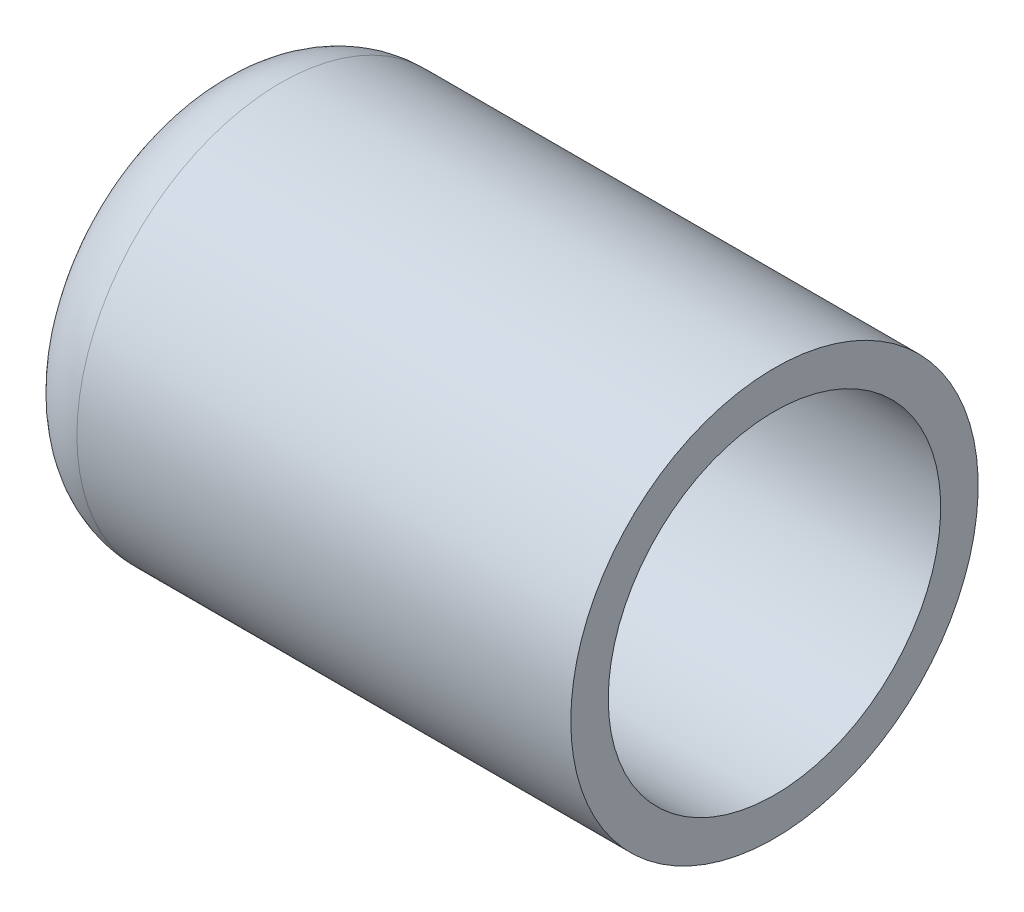
ISO-10303-21;
HEADER;
FILE_DESCRIPTION(('STEP AP214'),'2;1');
FILE_NAME('part.step','',(''),(''),'','','');
FILE_SCHEMA(('AUTOMOTIVE_DESIGN { 1 0 10303 214 1 1 1 1 }'));
ENDSEC;
DATA;
#1=APPLICATION_CONTEXT('core data for automotive mechanical design processes');
#2=APPLICATION_PROTOCOL_DEFINITION('international standard','automotive_design',2000,#1);
#3=PRODUCT_CONTEXT('',#1,'mechanical');
#4=PRODUCT('Part','Part','',(#3));
#5=PRODUCT_RELATED_PRODUCT_CATEGORY('part','',(#4));
#6=PRODUCT_DEFINITION_FORMATION('','',#4);
#7=PRODUCT_DEFINITION_CONTEXT('part definition',#1,'design');
#8=PRODUCT_DEFINITION('design','',#6,#7);
#9=PRODUCT_DEFINITION_SHAPE('','',#8);
#10=(LENGTH_UNIT() NAMED_UNIT(*) SI_UNIT(.MILLI.,.METRE.));
#11=(NAMED_UNIT(*) PLANE_ANGLE_UNIT() SI_UNIT($,.RADIAN.));
#12=(NAMED_UNIT(*) SI_UNIT($,.STERADIAN.) SOLID_ANGLE_UNIT());
#13=UNCERTAINTY_MEASURE_WITH_UNIT(LENGTH_MEASURE(1.E-05),#10,'distance_accuracy_value','');
#14=(GEOMETRIC_REPRESENTATION_CONTEXT(3) GLOBAL_UNCERTAINTY_ASSIGNED_CONTEXT((#13)) GLOBAL_UNIT_ASSIGNED_CONTEXT((#10,
#11,#12)) REPRESENTATION_CONTEXT('',''));
#15=CARTESIAN_POINT('',(0.,0.,0.));
#16=DIRECTION('',(0.,0.,1.));
#17=DIRECTION('',(1.,0.,0.));
#18=AXIS2_PLACEMENT_3D('',#15,#16,#17);
#19=CARTESIAN_POINT('',(-22.9999999999997,0.,0.));
#20=DIRECTION('',(0.,0.,1.));
#21=DIRECTION('',(-1.,0.,0.));
#22=AXIS2_PLACEMENT_3D('',#19,#20,#21);
#23=SPHERICAL_SURFACE('',#22,45.4000000000003);
#24=CARTESIAN_POINT('',(-64.8575600884697,0.,0.));
#25=DIRECTION('',(-1.,0.,0.));
#26=DIRECTION('',(0.,0.,1.));
#27=AXIS2_PLACEMENT_3D('',#24,#25,#26);
#28=CIRCLE('',#27,17.5813726267361);
#29=CARTESIAN_POINT('',(-64.8575600884697,0.,17.5813726267361));
#30=VERTEX_POINT('',#29);
#31=EDGE_CURVE('E17',#30,#30,#28,.T.);
#32=ORIENTED_EDGE('',*,*,#31,.F.);
#33=EDGE_LOOP('',(#32));
#34=FACE_BOUND('',#33,.T.);
#35=ADVANCED_FACE('F13',(#34),#23,.F.);
#36=CARTESIAN_POINT('',(-60.616485747608,0.,0.));
#37=DIRECTION('',(-1.,0.,0.));
#38=DIRECTION('',(0.,0.,1.));
#39=AXIS2_PLACEMENT_3D('',#36,#37,#38);
#40=TOROIDAL_SURFACE('',#39,15.8,4.60000000000002);
#41=CARTESIAN_POINT('',(-60.6164857476081,0.,0.));
#42=DIRECTION('',(-1.,0.,0.));
#43=DIRECTION('',(0.,1.,0.));
#44=AXIS2_PLACEMENT_3D('',#41,#42,#43);
#45=CIRCLE('',#44,20.4);
#46=CARTESIAN_POINT('',(-60.6164857476081,20.4,0.));
#47=VERTEX_POINT('',#46);
#48=EDGE_CURVE('E34',#47,#47,#45,.T.);
#49=ORIENTED_EDGE('',*,*,#48,.F.);
#50=EDGE_LOOP('',(#49));
#51=FACE_BOUND('',#50,.T.);
#52=ORIENTED_EDGE('',*,*,#31,.T.);
#53=EDGE_LOOP('',(#52));
#54=FACE_BOUND('',#53,.T.);
#55=ADVANCED_FACE('F44',(#51,#54),#40,.F.);
#56=CARTESIAN_POINT('',(0.,0.,0.));
#57=DIRECTION('',(-1.,0.,0.));
#58=DIRECTION('',(0.,0.,1.));
#59=AXIS2_PLACEMENT_3D('',#56,#57,#58);
#60=CYLINDRICAL_SURFACE('',#59,20.4);
#61=CARTESIAN_POINT('',(0.,0.,0.));
#62=DIRECTION('',(-1.,0.,0.));
#63=DIRECTION('',(0.,0.,1.));
#64=AXIS2_PLACEMENT_3D('',#61,#62,#63);
#65=CIRCLE('',#64,20.4);
#66=CARTESIAN_POINT('',(0.,0.,20.4));
#67=VERTEX_POINT('',#66);
#68=EDGE_CURVE('E32',#67,#67,#65,.T.);
#69=ORIENTED_EDGE('',*,*,#68,.F.);
#70=EDGE_LOOP('',(#69));
#71=FACE_BOUND('',#70,.T.);
#72=ORIENTED_EDGE('',*,*,#48,.T.);
#73=EDGE_LOOP('',(#72));
#74=FACE_BOUND('',#73,.T.);
#75=ADVANCED_FACE('F47',(#71,#74),#60,.F.);
#76=CARTESIAN_POINT('',(0.,25.,25.3000021083545));
#77=DIRECTION('',(1.,0.,0.));
#78=DIRECTION('',(0.,-1.,0.));
#79=AXIS2_PLACEMENT_3D('',#76,#77,#78);
#80=PLANE('',#79);
#81=ORIENTED_EDGE('',*,*,#68,.T.);
#82=EDGE_LOOP('',(#81));
#83=FACE_BOUND('',#82,.T.);
#84=CARTESIAN_POINT('',(0.,0.,0.));
#85=DIRECTION('',(-1.,0.,0.));
#86=DIRECTION('',(0.,0.,1.));
#87=AXIS2_PLACEMENT_3D('',#84,#85,#86);
#88=CIRCLE('',#87,25.);
#89=CARTESIAN_POINT('',(0.,0.,25.));
#90=VERTEX_POINT('',#89);
#91=EDGE_CURVE('E26',#90,#90,#88,.T.);
#92=ORIENTED_EDGE('',*,*,#91,.F.);
#93=EDGE_LOOP('',(#92));
#94=FACE_BOUND('',#93,.T.);
#95=ADVANCED_FACE('F51',(#83,#94),#80,.T.);
#96=CARTESIAN_POINT('',(-60.6164857476081,0.,0.));
#97=DIRECTION('',(-1.,0.,0.));
#98=DIRECTION('',(0.,0.,1.));
#99=AXIS2_PLACEMENT_3D('',#96,#97,#98);
#100=CYLINDRICAL_SURFACE('',#99,25.);
#101=ORIENTED_EDGE('',*,*,#91,.T.);
#102=EDGE_LOOP('',(#101));
#103=FACE_BOUND('',#102,.T.);
#104=CARTESIAN_POINT('',(-60.6164857476081,0.,0.));
#105=DIRECTION('',(-1.,0.,0.));
#106=DIRECTION('',(0.,0.,1.));
#107=AXIS2_PLACEMENT_3D('',#104,#105,#106);
#108=CIRCLE('',#107,25.);
#109=CARTESIAN_POINT('',(-60.6164857476081,0.,25.));
#110=VERTEX_POINT('',#109);
#111=EDGE_CURVE('E21',#110,#110,#108,.T.);
#112=ORIENTED_EDGE('',*,*,#111,.F.);
#113=EDGE_LOOP('',(#112));
#114=FACE_BOUND('',#113,.T.);
#115=ADVANCED_FACE('F55',(#103,#114),#100,.T.);
#116=CARTESIAN_POINT('',(-60.616485747608,0.,0.));
#117=DIRECTION('',(-1.,0.,0.));
#118=DIRECTION('',(0.,0.,1.));
#119=AXIS2_PLACEMENT_3D('',#116,#117,#118);
#120=TOROIDAL_SURFACE('',#119,15.8,9.20000000000003);
#121=ORIENTED_EDGE('',*,*,#111,.T.);
#122=EDGE_LOOP('',(#121));
#123=FACE_BOUND('',#122,.T.);
#124=CARTESIAN_POINT('',(-69.0986344946177,0.,0.));
#125=DIRECTION('',(-1.,0.,0.));
#126=DIRECTION('',(0.,0.,1.));
#127=AXIS2_PLACEMENT_3D('',#124,#125,#126);
#128=CIRCLE('',#127,19.3627450980392);
#129=CARTESIAN_POINT('',(-69.0986344946177,0.,19.3627450980392));
#130=VERTEX_POINT('',#129);
#131=EDGE_CURVE('E8',#130,#130,#128,.T.);
#132=ORIENTED_EDGE('',*,*,#131,.F.);
#133=EDGE_LOOP('',(#132));
#134=FACE_BOUND('',#133,.T.);
#135=ADVANCED_FACE('F58',(#123,#134),#120,.T.);
#136=CARTESIAN_POINT('',(-22.9999999999997,0.,0.));
#137=DIRECTION('',(0.,0.,1.));
#138=DIRECTION('',(1.,0.,0.));
#139=AXIS2_PLACEMENT_3D('',#136,#137,#138);
#140=SPHERICAL_SURFACE('',#139,50.0000000000003);
#141=ORIENTED_EDGE('',*,*,#131,.T.);
#142=EDGE_LOOP('',(#141));
#143=FACE_BOUND('',#142,.T.);
#144=ADVANCED_FACE('F62',(#143),#140,.T.);
#145=CLOSED_SHELL('',(#35,#55,#75,#95,#115,#135,#144));
#146=MANIFOLD_SOLID_BREP('B1',#145);
#147=ADVANCED_BREP_SHAPE_REPRESENTATION('',(#18,#146),#14);
#148=SHAPE_DEFINITION_REPRESENTATION(#9,#147);
ENDSEC;
END-ISO-10303-21;
